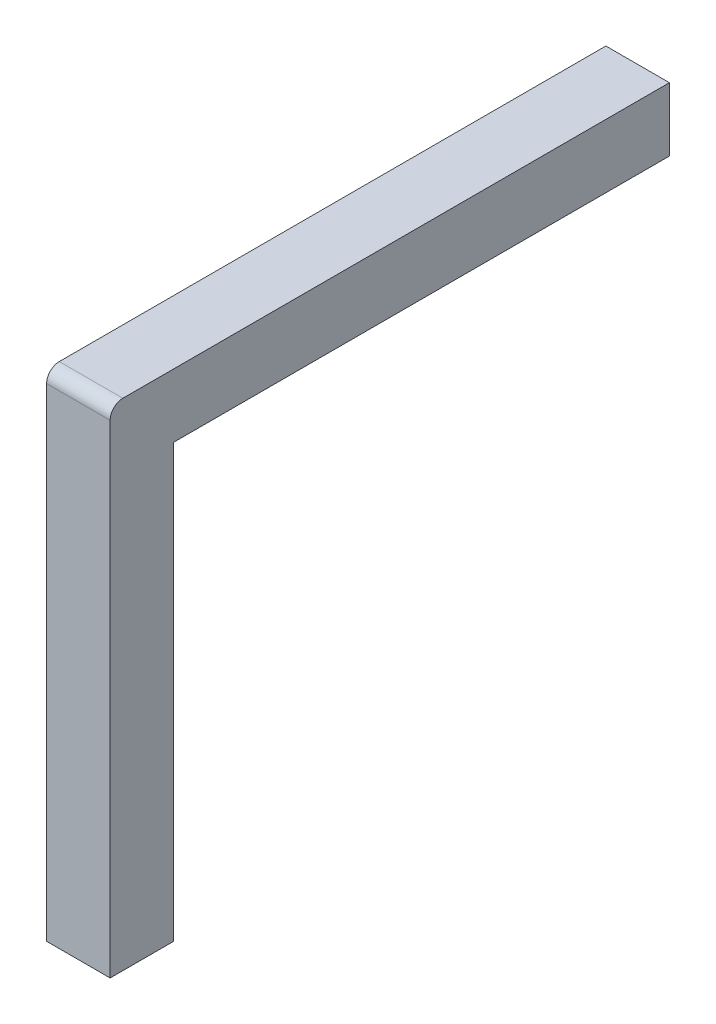
ISO-10303-21;
HEADER;
FILE_DESCRIPTION(('STEP AP214'),'2;1');
FILE_NAME('part.step','',(''),(''),'','','');
FILE_SCHEMA(('AUTOMOTIVE_DESIGN { 1 0 10303 214 1 1 1 1 }'));
ENDSEC;
DATA;
#1=APPLICATION_CONTEXT('core data for automotive mechanical design processes');
#2=APPLICATION_PROTOCOL_DEFINITION('international standard','automotive_design',2000,#1);
#3=PRODUCT_CONTEXT('',#1,'mechanical');
#4=PRODUCT('Part','Part','',(#3));
#5=PRODUCT_RELATED_PRODUCT_CATEGORY('part','',(#4));
#6=PRODUCT_DEFINITION_FORMATION('','',#4);
#7=PRODUCT_DEFINITION_CONTEXT('part definition',#1,'design');
#8=PRODUCT_DEFINITION('design','',#6,#7);
#9=PRODUCT_DEFINITION_SHAPE('','',#8);
#10=(LENGTH_UNIT() NAMED_UNIT(*) SI_UNIT(.MILLI.,.METRE.));
#11=(NAMED_UNIT(*) PLANE_ANGLE_UNIT() SI_UNIT($,.RADIAN.));
#12=(NAMED_UNIT(*) SI_UNIT($,.STERADIAN.) SOLID_ANGLE_UNIT());
#13=UNCERTAINTY_MEASURE_WITH_UNIT(LENGTH_MEASURE(1.E-05),#10,'distance_accuracy_value','');
#14=(GEOMETRIC_REPRESENTATION_CONTEXT(3) GLOBAL_UNCERTAINTY_ASSIGNED_CONTEXT((#13)) GLOBAL_UNIT_ASSIGNED_CONTEXT((#10,
#11,#12)) REPRESENTATION_CONTEXT('',''));
#15=CARTESIAN_POINT('',(0.,0.,0.));
#16=DIRECTION('',(0.,0.,1.));
#17=DIRECTION('',(1.,0.,0.));
#18=AXIS2_PLACEMENT_3D('',#15,#16,#17);
#19=CARTESIAN_POINT('',(-0.5,8.,-0.499999999999995));
#20=DIRECTION('',(0.,0.,1.));
#21=DIRECTION('',(1.,0.,0.));
#22=AXIS2_PLACEMENT_3D('',#19,#20,#21);
#23=PLANE('',#22);
#24=DIRECTION('',(0.,-1.,0.));
#25=VECTOR('',#24,1.);
#26=CARTESIAN_POINT('',(0.5,8.,-0.499999999999995));
#27=LINE('',#26,#25);
#28=CARTESIAN_POINT('',(0.5,7.,-0.499999999999995));
#29=VERTEX_POINT('',#28);
#30=CARTESIAN_POINT('',(0.5,0.199999999999999,-0.499999999999995));
#31=VERTEX_POINT('',#30);
#32=EDGE_CURVE('E131',#29,#31,#27,.T.);
#33=ORIENTED_EDGE('',*,*,#32,.T.);
#34=DIRECTION('',(-1.,0.,0.));
#35=VECTOR('',#34,1.);
#36=CARTESIAN_POINT('',(-0.5,0.199999999999999,-0.499999999999995));
#37=LINE('',#36,#35);
#38=CARTESIAN_POINT('',(-0.5,0.199999999999999,-0.499999999999995));
#39=VERTEX_POINT('',#38);
#40=EDGE_CURVE('E41',#31,#39,#37,.T.);
#41=ORIENTED_EDGE('',*,*,#40,.T.);
#42=DIRECTION('',(0.,-1.,0.));
#43=VECTOR('',#42,1.);
#44=CARTESIAN_POINT('',(-0.5,8.,-0.499999999999995));
#45=LINE('',#44,#43);
#46=CARTESIAN_POINT('',(-0.5,7.,-0.499999999999995));
#47=VERTEX_POINT('',#46);
#48=EDGE_CURVE('E119',#47,#39,#45,.T.);
#49=ORIENTED_EDGE('',*,*,#48,.F.);
#50=DIRECTION('',(-1.,0.,0.));
#51=VECTOR('',#50,1.);
#52=CARTESIAN_POINT('',(-0.5,7.,-0.499999999999995));
#53=LINE('',#52,#51);
#54=EDGE_CURVE('E128',#29,#47,#53,.T.);
#55=ORIENTED_EDGE('',*,*,#54,.F.);
#56=EDGE_LOOP('',(#33,#41,#49,#55));
#57=FACE_BOUND('',#56,.T.);
#58=ADVANCED_FACE('F32',(#57),#23,.F.);
#59=CARTESIAN_POINT('',(-0.5,8.,0.500000000000006));
#60=DIRECTION('',(0.,0.,-1.));
#61=DIRECTION('',(-1.,0.,0.));
#62=AXIS2_PLACEMENT_3D('',#59,#60,#61);
#63=PLANE('',#62);
#64=DIRECTION('',(0.,-1.,0.));
#65=VECTOR('',#64,1.);
#66=CARTESIAN_POINT('',(-0.5,8.,0.500000000000006));
#67=LINE('',#66,#65);
#68=CARTESIAN_POINT('',(-0.5,7.8,0.500000000000006));
#69=VERTEX_POINT('',#68);
#70=CARTESIAN_POINT('',(-0.5,0.199999999999999,0.500000000000006));
#71=VERTEX_POINT('',#70);
#72=EDGE_CURVE('E132',#69,#71,#67,.T.);
#73=ORIENTED_EDGE('',*,*,#72,.T.);
#74=DIRECTION('',(1.,0.,0.));
#75=VECTOR('',#74,1.);
#76=CARTESIAN_POINT('',(-0.5,0.199999999999999,0.500000000000006));
#77=LINE('',#76,#75);
#78=CARTESIAN_POINT('',(0.5,0.199999999999999,0.500000000000006));
#79=VERTEX_POINT('',#78);
#80=EDGE_CURVE('E194',#71,#79,#77,.T.);
#81=ORIENTED_EDGE('',*,*,#80,.T.);
#82=DIRECTION('',(0.,-1.,0.));
#83=VECTOR('',#82,1.);
#84=CARTESIAN_POINT('',(0.5,8.,0.500000000000006));
#85=LINE('',#84,#83);
#86=CARTESIAN_POINT('',(0.5,7.8,0.500000000000006));
#87=VERTEX_POINT('',#86);
#88=EDGE_CURVE('E159',#87,#79,#85,.T.);
#89=ORIENTED_EDGE('',*,*,#88,.F.);
#90=DIRECTION('',(1.,0.,0.));
#91=VECTOR('',#90,1.);
#92=CARTESIAN_POINT('',(-0.5,7.8,0.500000000000006));
#93=LINE('',#92,#91);
#94=EDGE_CURVE('E215',#87,#69,#93,.F.);
#95=ORIENTED_EDGE('',*,*,#94,.T.);
#96=EDGE_LOOP('',(#73,#81,#89,#95));
#97=FACE_BOUND('',#96,.T.);
#98=ADVANCED_FACE('F255',(#97),#63,.F.);
#99=CARTESIAN_POINT('',(0.5,8.,0.500000000000006));
#100=DIRECTION('',(-1.,0.,0.));
#101=DIRECTION('',(0.,0.,1.));
#102=AXIS2_PLACEMENT_3D('',#99,#100,#101);
#103=PLANE('',#102);
#104=ORIENTED_EDGE('',*,*,#88,.T.);
#105=DIRECTION('',(0.,0.,-1.));
#106=VECTOR('',#105,1.);
#107=CARTESIAN_POINT('',(0.5,0.199999999999999,0.500000000000006));
#108=LINE('',#107,#106);
#109=EDGE_CURVE('E56',#79,#31,#108,.T.);
#110=ORIENTED_EDGE('',*,*,#109,.T.);
#111=ORIENTED_EDGE('',*,*,#32,.F.);
#112=DIRECTION('',(0.,0.,1.));
#113=VECTOR('',#112,1.);
#114=CARTESIAN_POINT('',(0.5,7.,-8.49999999999999));
#115=LINE('',#114,#113);
#116=CARTESIAN_POINT('',(0.5,7.,-8.3));
#117=VERTEX_POINT('',#116);
#118=EDGE_CURVE('E127',#117,#29,#115,.T.);
#119=ORIENTED_EDGE('',*,*,#118,.F.);
#120=DIRECTION('',(0.,1.,0.));
#121=VECTOR('',#120,1.);
#122=CARTESIAN_POINT('',(0.5,8.,-8.3));
#123=LINE('',#122,#121);
#124=CARTESIAN_POINT('',(0.5,8.,-8.3));
#125=VERTEX_POINT('',#124);
#126=EDGE_CURVE('E205',#117,#125,#123,.T.);
#127=ORIENTED_EDGE('',*,*,#126,.T.);
#128=DIRECTION('',(0.,0.,-1.));
#129=VECTOR('',#128,1.);
#130=CARTESIAN_POINT('',(0.5,8.,0.500000000000006));
#131=LINE('',#130,#129);
#132=CARTESIAN_POINT('',(0.5,8.,0.300000000000006));
#133=VERTEX_POINT('',#132);
#134=EDGE_CURVE('E149',#133,#125,#131,.T.);
#135=ORIENTED_EDGE('',*,*,#134,.F.);
#136=CARTESIAN_POINT('',(0.5,7.8,0.300000000000006));
#137=DIRECTION('',(-1.,0.,0.));
#138=DIRECTION('',(0.,0.,1.));
#139=AXIS2_PLACEMENT_3D('',#136,#137,#138);
#140=CIRCLE('',#139,0.2);
#141=EDGE_CURVE('E163',#133,#87,#140,.F.);
#142=ORIENTED_EDGE('',*,*,#141,.T.);
#143=EDGE_LOOP('',(#104,#110,#111,#119,#127,#135,#142));
#144=FACE_BOUND('',#143,.T.);
#145=ADVANCED_FACE('F247',(#144),#103,.F.);
#146=CARTESIAN_POINT('',(-0.5,8.,0.500000000000006));
#147=DIRECTION('',(1.,0.,0.));
#148=DIRECTION('',(0.,0.,-1.));
#149=AXIS2_PLACEMENT_3D('',#146,#147,#148);
#150=PLANE('',#149);
#151=ORIENTED_EDGE('',*,*,#48,.T.);
#152=DIRECTION('',(0.,0.,1.));
#153=VECTOR('',#152,1.);
#154=CARTESIAN_POINT('',(-0.5,0.199999999999999,0.500000000000006));
#155=LINE('',#154,#153);
#156=EDGE_CURVE('E11',#39,#71,#155,.T.);
#157=ORIENTED_EDGE('',*,*,#156,.T.);
#158=ORIENTED_EDGE('',*,*,#72,.F.);
#159=CARTESIAN_POINT('',(-0.5,7.8,0.300000000000006));
#160=DIRECTION('',(1.,0.,0.));
#161=DIRECTION('',(0.,0.,-1.));
#162=AXIS2_PLACEMENT_3D('',#159,#160,#161);
#163=CIRCLE('',#162,0.2);
#164=CARTESIAN_POINT('',(-0.5,8.,0.300000000000006));
#165=VERTEX_POINT('',#164);
#166=EDGE_CURVE('E217',#69,#165,#163,.F.);
#167=ORIENTED_EDGE('',*,*,#166,.T.);
#168=DIRECTION('',(0.,0.,1.));
#169=VECTOR('',#168,1.);
#170=CARTESIAN_POINT('',(-0.5,8.,0.500000000000006));
#171=LINE('',#170,#169);
#172=CARTESIAN_POINT('',(-0.5,8.,-8.3));
#173=VERTEX_POINT('',#172);
#174=EDGE_CURVE('E152',#173,#165,#171,.T.);
#175=ORIENTED_EDGE('',*,*,#174,.F.);
#176=DIRECTION('',(0.,-1.,0.));
#177=VECTOR('',#176,1.);
#178=CARTESIAN_POINT('',(-0.5,8.,-8.3));
#179=LINE('',#178,#177);
#180=CARTESIAN_POINT('',(-0.5,7.,-8.3));
#181=VERTEX_POINT('',#180);
#182=EDGE_CURVE('E123',#173,#181,#179,.T.);
#183=ORIENTED_EDGE('',*,*,#182,.T.);
#184=DIRECTION('',(0.,0.,1.));
#185=VECTOR('',#184,1.);
#186=CARTESIAN_POINT('',(-0.5,7.,-8.49999999999999));
#187=LINE('',#186,#185);
#188=EDGE_CURVE('E117',#181,#47,#187,.T.);
#189=ORIENTED_EDGE('',*,*,#188,.T.);
#190=EDGE_LOOP('',(#151,#157,#158,#167,#175,#183,#189));
#191=FACE_BOUND('',#190,.T.);
#192=ADVANCED_FACE('F118',(#191),#150,.F.);
#193=CARTESIAN_POINT('',(0.,8.,0.));
#194=DIRECTION('',(0.,1.,0.));
#195=DIRECTION('',(0.,0.,1.));
#196=AXIS2_PLACEMENT_3D('',#193,#194,#195);
#197=PLANE('',#196);
#198=ORIENTED_EDGE('',*,*,#134,.T.);
#199=DIRECTION('',(-1.,0.,0.));
#200=VECTOR('',#199,1.);
#201=CARTESIAN_POINT('',(-0.5,8.,-8.3));
#202=LINE('',#201,#200);
#203=EDGE_CURVE('E195',#125,#173,#202,.T.);
#204=ORIENTED_EDGE('',*,*,#203,.T.);
#205=ORIENTED_EDGE('',*,*,#174,.T.);
#206=DIRECTION('',(1.,0.,0.));
#207=VECTOR('',#206,1.);
#208=CARTESIAN_POINT('',(0.5,8.,0.300000000000006));
#209=LINE('',#208,#207);
#210=EDGE_CURVE('E160',#165,#133,#209,.T.);
#211=ORIENTED_EDGE('',*,*,#210,.T.);
#212=EDGE_LOOP('',(#198,#204,#205,#211));
#213=FACE_BOUND('',#212,.T.);
#214=ADVANCED_FACE('F248',(#213),#197,.T.);
#215=CARTESIAN_POINT('',(0.,0.,0.));
#216=DIRECTION('',(0.,1.,0.));
#217=DIRECTION('',(0.,0.,1.));
#218=AXIS2_PLACEMENT_3D('',#215,#216,#217);
#219=PLANE('',#218);
#220=DIRECTION('',(0.,0.,1.));
#221=VECTOR('',#220,1.);
#222=CARTESIAN_POINT('',(0.299999999999999,0.,0.));
#223=LINE('',#222,#221);
#224=CARTESIAN_POINT('',(0.299999999999999,0.,-0.299999999999995));
#225=VERTEX_POINT('',#224);
#226=CARTESIAN_POINT('',(0.299999999999999,0.,0.300000000000005));
#227=VERTEX_POINT('',#226);
#228=EDGE_CURVE('E178',#225,#227,#223,.T.);
#229=ORIENTED_EDGE('',*,*,#228,.T.);
#230=DIRECTION('',(-1.,0.,0.));
#231=VECTOR('',#230,1.);
#232=CARTESIAN_POINT('',(0.,0.,0.300000000000005));
#233=LINE('',#232,#231);
#234=CARTESIAN_POINT('',(-0.299999999999999,0.,0.300000000000005));
#235=VERTEX_POINT('',#234);
#236=EDGE_CURVE('E186',#227,#235,#233,.T.);
#237=ORIENTED_EDGE('',*,*,#236,.T.);
#238=DIRECTION('',(0.,0.,-1.));
#239=VECTOR('',#238,1.);
#240=CARTESIAN_POINT('',(-0.299999999999999,0.,0.));
#241=LINE('',#240,#239);
#242=CARTESIAN_POINT('',(-0.299999999999999,0.,-0.299999999999995));
#243=VERTEX_POINT('',#242);
#244=EDGE_CURVE('E192',#235,#243,#241,.T.);
#245=ORIENTED_EDGE('',*,*,#244,.T.);
#246=DIRECTION('',(1.,0.,0.));
#247=VECTOR('',#246,1.);
#248=CARTESIAN_POINT('',(0.,0.,-0.299999999999995));
#249=LINE('',#248,#247);
#250=EDGE_CURVE('E190',#243,#225,#249,.T.);
#251=ORIENTED_EDGE('',*,*,#250,.T.);
#252=EDGE_LOOP('',(#229,#237,#245,#251));
#253=FACE_BOUND('',#252,.T.);
#254=ADVANCED_FACE('F264',(#253),#219,.F.);
#255=CARTESIAN_POINT('',(-0.5,7.,-8.49999999999999));
#256=DIRECTION('',(0.,1.,0.));
#257=DIRECTION('',(0.,0.,1.));
#258=AXIS2_PLACEMENT_3D('',#255,#256,#257);
#259=PLANE('',#258);
#260=ORIENTED_EDGE('',*,*,#188,.F.);
#261=DIRECTION('',(1.,0.,0.));
#262=VECTOR('',#261,1.);
#263=CARTESIAN_POINT('',(-0.5,7.,-8.3));
#264=LINE('',#263,#262);
#265=EDGE_CURVE('E204',#181,#117,#264,.T.);
#266=ORIENTED_EDGE('',*,*,#265,.T.);
#267=ORIENTED_EDGE('',*,*,#118,.T.);
#268=ORIENTED_EDGE('',*,*,#54,.T.);
#269=EDGE_LOOP('',(#260,#266,#267,#268));
#270=FACE_BOUND('',#269,.T.);
#271=ADVANCED_FACE('F134',(#270),#259,.F.);
#272=CARTESIAN_POINT('',(0.,0.,-8.49999999999999));
#273=DIRECTION('',(0.,0.,1.));
#274=DIRECTION('',(1.,0.,0.));
#275=AXIS2_PLACEMENT_3D('',#272,#273,#274);
#276=PLANE('',#275);
#277=DIRECTION('',(1.,0.,0.));
#278=VECTOR('',#277,1.);
#279=CARTESIAN_POINT('',(0.5,7.8,-8.49999999999999));
#280=LINE('',#279,#278);
#281=CARTESIAN_POINT('',(-0.299999999999999,7.8,-8.49999999999999));
#282=VERTEX_POINT('',#281);
#283=CARTESIAN_POINT('',(0.299999999999999,7.8,-8.49999999999999));
#284=VERTEX_POINT('',#283);
#285=EDGE_CURVE('E220',#282,#284,#280,.T.);
#286=ORIENTED_EDGE('',*,*,#285,.T.);
#287=DIRECTION('',(0.,-1.,0.));
#288=VECTOR('',#287,1.);
#289=CARTESIAN_POINT('',(0.299999999999999,0.,-8.49999999999999));
#290=LINE('',#289,#288);
#291=CARTESIAN_POINT('',(0.299999999999999,7.2,-8.49999999999999));
#292=VERTEX_POINT('',#291);
#293=EDGE_CURVE('E209',#284,#292,#290,.T.);
#294=ORIENTED_EDGE('',*,*,#293,.T.);
#295=DIRECTION('',(-1.,0.,0.));
#296=VECTOR('',#295,1.);
#297=CARTESIAN_POINT('',(0.,7.2,-8.49999999999999));
#298=LINE('',#297,#296);
#299=CARTESIAN_POINT('',(-0.299999999999999,7.2,-8.49999999999999));
#300=VERTEX_POINT('',#299);
#301=EDGE_CURVE('E223',#292,#300,#298,.T.);
#302=ORIENTED_EDGE('',*,*,#301,.T.);
#303=DIRECTION('',(0.,1.,0.));
#304=VECTOR('',#303,1.);
#305=CARTESIAN_POINT('',(-0.299999999999999,0.,-8.49999999999999));
#306=LINE('',#305,#304);
#307=EDGE_CURVE('E222',#300,#282,#306,.T.);
#308=ORIENTED_EDGE('',*,*,#307,.T.);
#309=EDGE_LOOP('',(#286,#294,#302,#308));
#310=FACE_BOUND('',#309,.T.);
#311=ADVANCED_FACE('F229',(#310),#276,.F.);
#312=CARTESIAN_POINT('',(0.,7.8,0.300000000000006));
#313=DIRECTION('',(-1.,0.,0.));
#314=DIRECTION('',(0.,0.,1.));
#315=AXIS2_PLACEMENT_3D('',#312,#313,#314);
#316=CYLINDRICAL_SURFACE('',#315,0.2);
#317=ORIENTED_EDGE('',*,*,#166,.F.);
#318=ORIENTED_EDGE('',*,*,#94,.F.);
#319=ORIENTED_EDGE('',*,*,#141,.F.);
#320=ORIENTED_EDGE('',*,*,#210,.F.);
#321=EDGE_LOOP('',(#317,#318,#319,#320));
#322=FACE_BOUND('',#321,.T.);
#323=ADVANCED_FACE('F252',(#322),#316,.T.);
#324=CARTESIAN_POINT('',(-0.299999999999999,0.,-8.49999999999999));
#325=DIRECTION('',(0.707106781186547,0.,0.707106781186547));
#326=DIRECTION('',(0.,1.,0.));
#327=AXIS2_PLACEMENT_3D('',#324,#325,#326);
#328=PLANE('',#327);
#329=DIRECTION('',(-0.577350269189626,-0.577350269189626,0.577350269189626));
#330=VECTOR('',#329,1.);
#331=CARTESIAN_POINT('',(-2.7,4.8,-6.09999999999999));
#332=LINE('',#331,#330);
#333=EDGE_CURVE('E139',#181,#300,#332,.F.);
#334=ORIENTED_EDGE('',*,*,#333,.F.);
#335=ORIENTED_EDGE('',*,*,#182,.F.);
#336=DIRECTION('',(0.577350269189626,-0.577350269189626,-0.577350269189626));
#337=VECTOR('',#336,1.);
#338=CARTESIAN_POINT('',(-0.2,7.7,-8.59999999999999));
#339=LINE('',#338,#337);
#340=EDGE_CURVE('E136',#282,#173,#339,.F.);
#341=ORIENTED_EDGE('',*,*,#340,.F.);
#342=ORIENTED_EDGE('',*,*,#307,.F.);
#343=EDGE_LOOP('',(#334,#335,#341,#342));
#344=FACE_BOUND('',#343,.T.);
#345=ADVANCED_FACE('F241',(#344),#328,.F.);
#346=CARTESIAN_POINT('',(0.,7.8,-8.49999999999999));
#347=DIRECTION('',(0.,0.707106781186547,-0.707106781186547));
#348=DIRECTION('',(-1.,0.,0.));
#349=AXIS2_PLACEMENT_3D('',#346,#347,#348);
#350=PLANE('',#349);
#351=ORIENTED_EDGE('',*,*,#340,.T.);
#352=ORIENTED_EDGE('',*,*,#203,.F.);
#353=DIRECTION('',(0.577350269189626,0.577350269189626,0.577350269189626));
#354=VECTOR('',#353,1.);
#355=CARTESIAN_POINT('',(0.2,7.7,-8.59999999999999));
#356=LINE('',#355,#354);
#357=EDGE_CURVE('E199',#284,#125,#356,.T.);
#358=ORIENTED_EDGE('',*,*,#357,.F.);
#359=ORIENTED_EDGE('',*,*,#285,.F.);
#360=EDGE_LOOP('',(#351,#352,#358,#359));
#361=FACE_BOUND('',#360,.T.);
#362=ADVANCED_FACE('F244',(#361),#350,.T.);
#363=CARTESIAN_POINT('',(0.,7.2,-8.49999999999999));
#364=DIRECTION('',(0.,0.707106781186547,0.707106781186547));
#365=DIRECTION('',(-1.,0.,0.));
#366=AXIS2_PLACEMENT_3D('',#363,#364,#365);
#367=PLANE('',#366);
#368=ORIENTED_EDGE('',*,*,#333,.T.);
#369=ORIENTED_EDGE('',*,*,#301,.F.);
#370=DIRECTION('',(0.577350269189626,-0.577350269189626,0.577350269189626));
#371=VECTOR('',#370,1.);
#372=CARTESIAN_POINT('',(0.2,7.3,-8.59999999999999));
#373=LINE('',#372,#371);
#374=EDGE_CURVE('E180',#117,#292,#373,.F.);
#375=ORIENTED_EDGE('',*,*,#374,.F.);
#376=ORIENTED_EDGE('',*,*,#265,.F.);
#377=EDGE_LOOP('',(#368,#369,#375,#376));
#378=FACE_BOUND('',#377,.T.);
#379=ADVANCED_FACE('F239',(#378),#367,.F.);
#380=CARTESIAN_POINT('',(0.299999999999999,0.,-8.49999999999999));
#381=DIRECTION('',(-0.707106781186547,0.,0.707106781186547));
#382=DIRECTION('',(0.,-1.,0.));
#383=AXIS2_PLACEMENT_3D('',#380,#381,#382);
#384=PLANE('',#383);
#385=ORIENTED_EDGE('',*,*,#357,.T.);
#386=ORIENTED_EDGE('',*,*,#126,.F.);
#387=ORIENTED_EDGE('',*,*,#374,.T.);
#388=ORIENTED_EDGE('',*,*,#293,.F.);
#389=EDGE_LOOP('',(#385,#386,#387,#388));
#390=FACE_BOUND('',#389,.T.);
#391=ADVANCED_FACE('F233',(#390),#384,.F.);
#392=CARTESIAN_POINT('',(-0.5,0.199999999999999,-0.499999999999995));
#393=DIRECTION('',(0.,0.707106781186551,0.707106781186544));
#394=DIRECTION('',(-1.,0.,0.));
#395=AXIS2_PLACEMENT_3D('',#392,#393,#394);
#396=PLANE('',#395);
#397=DIRECTION('',(-0.577350269189627,-0.577350269189622,0.577350269189627));
#398=VECTOR('',#397,1.);
#399=CARTESIAN_POINT('',(0.166666666666665,-0.133333333333334,-0.16666666666666));
#400=LINE('',#399,#398);
#401=EDGE_CURVE('E169',#225,#31,#400,.F.);
#402=ORIENTED_EDGE('',*,*,#401,.F.);
#403=ORIENTED_EDGE('',*,*,#250,.F.);
#404=DIRECTION('',(0.577350269189627,-0.577350269189622,0.577350269189627));
#405=VECTOR('',#404,1.);
#406=CARTESIAN_POINT('',(-0.166666666666664,-0.133333333333334,-0.16666666666666));
#407=LINE('',#406,#405);
#408=EDGE_CURVE('E36',#39,#243,#407,.T.);
#409=ORIENTED_EDGE('',*,*,#408,.F.);
#410=ORIENTED_EDGE('',*,*,#40,.F.);
#411=EDGE_LOOP('',(#402,#403,#409,#410));
#412=FACE_BOUND('',#411,.T.);
#413=ADVANCED_FACE('F34',(#412),#396,.F.);
#414=CARTESIAN_POINT('',(-0.5,0.199999999999999,0.500000000000006));
#415=DIRECTION('',(0.707106781186544,0.707106781186551,0.));
#416=DIRECTION('',(0.,0.,1.));
#417=AXIS2_PLACEMENT_3D('',#414,#415,#416);
#418=PLANE('',#417);
#419=ORIENTED_EDGE('',*,*,#408,.T.);
#420=ORIENTED_EDGE('',*,*,#244,.F.);
#421=DIRECTION('',(-0.577350269189627,0.577350269189622,0.577350269189627));
#422=VECTOR('',#421,1.);
#423=CARTESIAN_POINT('',(-0.5,0.199999999999999,0.500000000000006));
#424=LINE('',#423,#422);
#425=EDGE_CURVE('E179',#71,#235,#424,.F.);
#426=ORIENTED_EDGE('',*,*,#425,.F.);
#427=ORIENTED_EDGE('',*,*,#156,.F.);
#428=EDGE_LOOP('',(#419,#420,#426,#427));
#429=FACE_BOUND('',#428,.T.);
#430=ADVANCED_FACE('F266',(#429),#418,.F.);
#431=CARTESIAN_POINT('',(0.5,0.199999999999999,0.500000000000006));
#432=DIRECTION('',(-0.707106781186544,0.707106781186551,0.));
#433=DIRECTION('',(0.,0.,-1.));
#434=AXIS2_PLACEMENT_3D('',#431,#432,#433);
#435=PLANE('',#434);
#436=ORIENTED_EDGE('',*,*,#401,.T.);
#437=ORIENTED_EDGE('',*,*,#109,.F.);
#438=DIRECTION('',(-0.577350269189627,-0.577350269189622,-0.577350269189627));
#439=VECTOR('',#438,1.);
#440=CARTESIAN_POINT('',(0.5,0.199999999999999,0.500000000000006));
#441=LINE('',#440,#439);
#442=EDGE_CURVE('E181',#227,#79,#441,.F.);
#443=ORIENTED_EDGE('',*,*,#442,.F.);
#444=ORIENTED_EDGE('',*,*,#228,.F.);
#445=EDGE_LOOP('',(#436,#437,#443,#444));
#446=FACE_BOUND('',#445,.T.);
#447=ADVANCED_FACE('F175',(#446),#435,.F.);
#448=CARTESIAN_POINT('',(-0.5,0.199999999999999,0.500000000000006));
#449=DIRECTION('',(0.,0.707106781186551,-0.707106781186544));
#450=DIRECTION('',(1.,0.,0.));
#451=AXIS2_PLACEMENT_3D('',#448,#449,#450);
#452=PLANE('',#451);
#453=ORIENTED_EDGE('',*,*,#425,.T.);
#454=ORIENTED_EDGE('',*,*,#236,.F.);
#455=ORIENTED_EDGE('',*,*,#442,.T.);
#456=ORIENTED_EDGE('',*,*,#80,.F.);
#457=EDGE_LOOP('',(#453,#454,#455,#456));
#458=FACE_BOUND('',#457,.T.);
#459=ADVANCED_FACE('F260',(#458),#452,.F.);
#460=CLOSED_SHELL('',(#58,#98,#145,#192,#214,#254,#271,#311,#323,#345,#362,#379,#391,#413,#430,
#447,#459));
#461=MANIFOLD_SOLID_BREP('B2',#460);
#462=ADVANCED_BREP_SHAPE_REPRESENTATION('',(#18,#461),#14);
#463=SHAPE_DEFINITION_REPRESENTATION(#9,#462);
ENDSEC;
END-ISO-10303-21;
